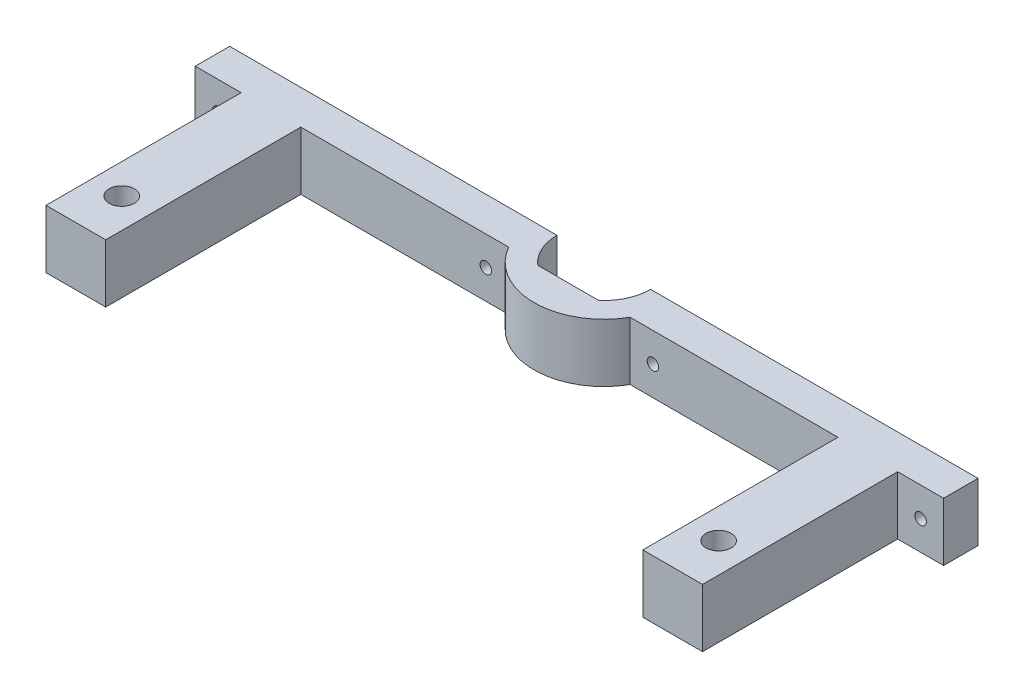
ISO-10303-21;
HEADER;
FILE_DESCRIPTION(('STEP AP214'),'2;1');
FILE_NAME('part.step','',(''),(''),'','','');
FILE_SCHEMA(('AUTOMOTIVE_DESIGN { 1 0 10303 214 1 1 1 1 }'));
ENDSEC;
DATA;
#1=APPLICATION_CONTEXT('core data for automotive mechanical design processes');
#2=APPLICATION_PROTOCOL_DEFINITION('international standard','automotive_design',2000,#1);
#3=PRODUCT_CONTEXT('',#1,'mechanical');
#4=PRODUCT('Part','Part','',(#3));
#5=PRODUCT_RELATED_PRODUCT_CATEGORY('part','',(#4));
#6=PRODUCT_DEFINITION_FORMATION('','',#4);
#7=PRODUCT_DEFINITION_CONTEXT('part definition',#1,'design');
#8=PRODUCT_DEFINITION('design','',#6,#7);
#9=PRODUCT_DEFINITION_SHAPE('','',#8);
#10=(LENGTH_UNIT() NAMED_UNIT(*) SI_UNIT(.MILLI.,.METRE.));
#11=(NAMED_UNIT(*) PLANE_ANGLE_UNIT() SI_UNIT($,.RADIAN.));
#12=(NAMED_UNIT(*) SI_UNIT($,.STERADIAN.) SOLID_ANGLE_UNIT());
#13=UNCERTAINTY_MEASURE_WITH_UNIT(LENGTH_MEASURE(1.E-05),#10,'distance_accuracy_value','');
#14=(GEOMETRIC_REPRESENTATION_CONTEXT(3) GLOBAL_UNCERTAINTY_ASSIGNED_CONTEXT((#13)) GLOBAL_UNIT_ASSIGNED_CONTEXT((#10,
#11,#12)) REPRESENTATION_CONTEXT('',''));
#15=CARTESIAN_POINT('',(0.,0.,0.));
#16=DIRECTION('',(0.,0.,1.));
#17=DIRECTION('',(1.,0.,0.));
#18=AXIS2_PLACEMENT_3D('',#15,#16,#17);
#19=CARTESIAN_POINT('',(3.50000000000001,-17.3,0.));
#20=DIRECTION('',(1.,0.,0.));
#21=DIRECTION('',(0.,0.,-1.));
#22=AXIS2_PLACEMENT_3D('',#19,#20,#21);
#23=PLANE('',#22);
#24=DIRECTION('',(0.,1.,0.));
#25=VECTOR('',#24,1.);
#26=CARTESIAN_POINT('',(3.50000000000001,0.,-42.5));
#27=LINE('',#26,#25);
#28=CARTESIAN_POINT('',(3.50000000000001,0.,-42.5));
#29=VERTEX_POINT('',#28);
#30=CARTESIAN_POINT('',(3.50000000000001,12.7,-42.5));
#31=VERTEX_POINT('',#30);
#32=EDGE_CURVE('E109',#29,#31,#27,.T.);
#33=ORIENTED_EDGE('',*,*,#32,.F.);
#34=DIRECTION('',(0.,0.,1.));
#35=VECTOR('',#34,1.);
#36=CARTESIAN_POINT('',(3.50000000000001,0.,0.));
#37=LINE('',#36,#35);
#38=CARTESIAN_POINT('',(3.50000000000001,0.,0.));
#39=VERTEX_POINT('',#38);
#40=EDGE_CURVE('E313',#29,#39,#37,.T.);
#41=ORIENTED_EDGE('',*,*,#40,.T.);
#42=DIRECTION('',(0.,-1.,0.));
#43=VECTOR('',#42,1.);
#44=CARTESIAN_POINT('',(3.50000000000001,12.7,0.));
#45=LINE('',#44,#43);
#46=CARTESIAN_POINT('',(3.50000000000001,12.7,0.));
#47=VERTEX_POINT('',#46);
#48=EDGE_CURVE('E363',#47,#39,#45,.T.);
#49=ORIENTED_EDGE('',*,*,#48,.F.);
#50=DIRECTION('',(0.,0.,-1.));
#51=VECTOR('',#50,1.);
#52=CARTESIAN_POINT('',(3.50000000000001,12.7,0.));
#53=LINE('',#52,#51);
#54=EDGE_CURVE('E278',#47,#31,#53,.T.);
#55=ORIENTED_EDGE('',*,*,#54,.T.);
#56=EDGE_LOOP('',(#33,#41,#49,#55));
#57=FACE_BOUND('',#56,.T.);
#58=ADVANCED_FACE('F92',(#57),#23,.F.);
#59=CARTESIAN_POINT('',(146.5,-17.3,0.));
#60=DIRECTION('',(-1.,0.,0.));
#61=DIRECTION('',(0.,0.,1.));
#62=AXIS2_PLACEMENT_3D('',#59,#60,#61);
#63=PLANE('',#62);
#64=DIRECTION('',(0.,-1.,0.));
#65=VECTOR('',#64,1.);
#66=CARTESIAN_POINT('',(146.5,0.,-42.5));
#67=LINE('',#66,#65);
#68=CARTESIAN_POINT('',(146.5,12.7,-42.5));
#69=VERTEX_POINT('',#68);
#70=CARTESIAN_POINT('',(146.5,0.,-42.5));
#71=VERTEX_POINT('',#70);
#72=EDGE_CURVE('E117',#69,#71,#67,.T.);
#73=ORIENTED_EDGE('',*,*,#72,.F.);
#74=DIRECTION('',(0.,0.,1.));
#75=VECTOR('',#74,1.);
#76=CARTESIAN_POINT('',(146.5,12.7,0.));
#77=LINE('',#76,#75);
#78=CARTESIAN_POINT('',(146.5,12.7,0.));
#79=VERTEX_POINT('',#78);
#80=EDGE_CURVE('E276',#69,#79,#77,.T.);
#81=ORIENTED_EDGE('',*,*,#80,.T.);
#82=DIRECTION('',(0.,1.,0.));
#83=VECTOR('',#82,1.);
#84=CARTESIAN_POINT('',(146.5,-17.3,0.));
#85=LINE('',#84,#83);
#86=CARTESIAN_POINT('',(146.5,0.,0.));
#87=VERTEX_POINT('',#86);
#88=EDGE_CURVE('E282',#87,#79,#85,.T.);
#89=ORIENTED_EDGE('',*,*,#88,.F.);
#90=DIRECTION('',(0.,0.,-1.));
#91=VECTOR('',#90,1.);
#92=CARTESIAN_POINT('',(146.5,0.,0.));
#93=LINE('',#92,#91);
#94=EDGE_CURVE('E311',#87,#71,#93,.T.);
#95=ORIENTED_EDGE('',*,*,#94,.T.);
#96=EDGE_LOOP('',(#73,#81,#89,#95));
#97=FACE_BOUND('',#96,.T.);
#98=ADVANCED_FACE('F400',(#97),#63,.F.);
#99=CARTESIAN_POINT('',(0.,12.7,0.));
#100=DIRECTION('',(0.,0.,-1.));
#101=DIRECTION('',(-1.,0.,0.));
#102=AXIS2_PLACEMENT_3D('',#99,#100,#101);
#103=PLANE('',#102);
#104=DIRECTION('',(1.,0.,0.));
#105=VECTOR('',#104,1.);
#106=CARTESIAN_POINT('',(0.,12.7,0.));
#107=LINE('',#106,#105);
#108=CARTESIAN_POINT('',(16.5,12.7,0.));
#109=VERTEX_POINT('',#108);
#110=EDGE_CURVE('E350',#47,#109,#107,.T.);
#111=ORIENTED_EDGE('',*,*,#110,.F.);
#112=ORIENTED_EDGE('',*,*,#48,.T.);
#113=DIRECTION('',(1.,0.,0.));
#114=VECTOR('',#113,1.);
#115=CARTESIAN_POINT('',(0.,0.,0.));
#116=LINE('',#115,#114);
#117=CARTESIAN_POINT('',(16.5,0.,0.));
#118=VERTEX_POINT('',#117);
#119=EDGE_CURVE('E351',#39,#118,#116,.T.);
#120=ORIENTED_EDGE('',*,*,#119,.T.);
#121=DIRECTION('',(0.,-1.,0.));
#122=VECTOR('',#121,1.);
#123=CARTESIAN_POINT('',(16.5,12.7,0.));
#124=LINE('',#123,#122);
#125=EDGE_CURVE('E358',#109,#118,#124,.T.);
#126=ORIENTED_EDGE('',*,*,#125,.F.);
#127=EDGE_LOOP('',(#111,#112,#120,#126));
#128=FACE_BOUND('',#127,.T.);
#129=ADVANCED_FACE('F405',(#128),#103,.F.);
#130=CARTESIAN_POINT('',(75.,0.,-50.));
#131=DIRECTION('',(0.,1.,0.));
#132=DIRECTION('',(0.,0.,1.));
#133=AXIS2_PLACEMENT_3D('',#130,#131,#132);
#134=CYLINDRICAL_SURFACE('',#133,10.2);
#135=CARTESIAN_POINT('',(75.,12.7,-50.));
#136=DIRECTION('',(0.,1.,0.));
#137=DIRECTION('',(0.,0.,1.));
#138=AXIS2_PLACEMENT_3D('',#135,#136,#137);
#139=CIRCLE('',#138,10.2);
#140=CARTESIAN_POINT('',(81.6315533625237,12.7,-42.25));
#141=VERTEX_POINT('',#140);
#142=CARTESIAN_POINT('',(85.2,12.7,-50.));
#143=VERTEX_POINT('',#142);
#144=EDGE_CURVE('E331',#141,#143,#139,.T.);
#145=ORIENTED_EDGE('',*,*,#144,.T.);
#146=DIRECTION('',(0.,1.,0.));
#147=VECTOR('',#146,1.);
#148=CARTESIAN_POINT('',(85.2,0.,-50.));
#149=LINE('',#148,#147);
#150=CARTESIAN_POINT('',(85.2,0.,-50.));
#151=VERTEX_POINT('',#150);
#152=EDGE_CURVE('E354',#151,#143,#149,.T.);
#153=ORIENTED_EDGE('',*,*,#152,.F.);
#154=CARTESIAN_POINT('',(75.,0.,-50.));
#155=DIRECTION('',(0.,1.,0.));
#156=DIRECTION('',(0.,0.,1.));
#157=AXIS2_PLACEMENT_3D('',#154,#155,#156);
#158=CIRCLE('',#157,10.2);
#159=CARTESIAN_POINT('',(81.6315533625237,0.,-42.25));
#160=VERTEX_POINT('',#159);
#161=EDGE_CURVE('E334',#160,#151,#158,.T.);
#162=ORIENTED_EDGE('',*,*,#161,.F.);
#163=DIRECTION('',(0.,1.,0.));
#164=VECTOR('',#163,1.);
#165=CARTESIAN_POINT('',(81.6315533625237,0.,-42.25));
#166=LINE('',#165,#164);
#167=EDGE_CURVE('E342',#160,#141,#166,.T.);
#168=ORIENTED_EDGE('',*,*,#167,.T.);
#169=EDGE_LOOP('',(#145,#153,#162,#168));
#170=FACE_BOUND('',#169,.T.);
#171=ADVANCED_FACE('F438',(#170),#134,.F.);
#172=CARTESIAN_POINT('',(0.,12.7,0.));
#173=DIRECTION('',(0.,-1.,0.));
#174=DIRECTION('',(0.,0.,-1.));
#175=AXIS2_PLACEMENT_3D('',#172,#173,#174);
#176=PLANE('',#175);
#177=CARTESIAN_POINT('',(75.,12.7,-50.));
#178=DIRECTION('',(0.,1.,0.));
#179=DIRECTION('',(0.,0.,1.));
#180=AXIS2_PLACEMENT_3D('',#177,#178,#179);
#181=CIRCLE('',#180,10.2);
#182=CARTESIAN_POINT('',(64.8,12.7,-50.));
#183=VERTEX_POINT('',#182);
#184=CARTESIAN_POINT('',(68.3684466374763,12.7,-42.25));
#185=VERTEX_POINT('',#184);
#186=EDGE_CURVE('E319',#183,#185,#181,.T.);
#187=ORIENTED_EDGE('',*,*,#186,.F.);
#188=DIRECTION('',(1.,0.,0.));
#189=VECTOR('',#188,1.);
#190=CARTESIAN_POINT('',(0.,12.7,-50.));
#191=LINE('',#190,#189);
#192=CARTESIAN_POINT('',(-6.49999999999999,12.7,-50.));
#193=VERTEX_POINT('',#192);
#194=EDGE_CURVE('E280',#193,#183,#191,.T.);
#195=ORIENTED_EDGE('',*,*,#194,.F.);
#196=DIRECTION('',(0.,0.,-1.));
#197=VECTOR('',#196,1.);
#198=CARTESIAN_POINT('',(-6.49999999999999,12.7,-50.));
#199=LINE('',#198,#197);
#200=CARTESIAN_POINT('',(-6.49999999999999,12.7,-42.5));
#201=VERTEX_POINT('',#200);
#202=EDGE_CURVE('E243',#201,#193,#199,.T.);
#203=ORIENTED_EDGE('',*,*,#202,.F.);
#204=DIRECTION('',(1.,0.,0.));
#205=VECTOR('',#204,1.);
#206=CARTESIAN_POINT('',(-6.49999999999999,12.7,-42.5));
#207=LINE('',#206,#205);
#208=EDGE_CURVE('E251',#201,#31,#207,.T.);
#209=ORIENTED_EDGE('',*,*,#208,.T.);
#210=ORIENTED_EDGE('',*,*,#54,.F.);
#211=ORIENTED_EDGE('',*,*,#110,.T.);
#212=DIRECTION('',(0.,0.,-1.));
#213=VECTOR('',#212,1.);
#214=CARTESIAN_POINT('',(16.5,12.7,0.));
#215=LINE('',#214,#213);
#216=CARTESIAN_POINT('',(16.5,12.7,-42.5));
#217=VERTEX_POINT('',#216);
#218=EDGE_CURVE('E291',#109,#217,#215,.T.);
#219=ORIENTED_EDGE('',*,*,#218,.T.);
#220=DIRECTION('',(-1.,0.,0.));
#221=VECTOR('',#220,1.);
#222=CARTESIAN_POINT('',(0.,12.7,-42.5));
#223=LINE('',#222,#221);
#224=CARTESIAN_POINT('',(61.7791830812162,12.7,-42.5));
#225=VERTEX_POINT('',#224);
#226=EDGE_CURVE('E288',#225,#217,#223,.T.);
#227=ORIENTED_EDGE('',*,*,#226,.F.);
#228=CARTESIAN_POINT('',(75.,12.7,-50.));
#229=DIRECTION('',(0.,1.,0.));
#230=DIRECTION('',(0.,0.,1.));
#231=AXIS2_PLACEMENT_3D('',#228,#229,#230);
#232=CIRCLE('',#231,15.2);
#233=CARTESIAN_POINT('',(88.2208169187838,12.7,-42.5));
#234=VERTEX_POINT('',#233);
#235=EDGE_CURVE('E285',#225,#234,#232,.T.);
#236=ORIENTED_EDGE('',*,*,#235,.T.);
#237=CARTESIAN_POINT('',(133.5,12.7,-42.5));
#238=VERTEX_POINT('',#237);
#239=EDGE_CURVE('E292',#238,#234,#223,.T.);
#240=ORIENTED_EDGE('',*,*,#239,.F.);
#241=DIRECTION('',(0.,0.,-1.));
#242=VECTOR('',#241,1.);
#243=CARTESIAN_POINT('',(133.5,12.7,0.));
#244=LINE('',#243,#242);
#245=CARTESIAN_POINT('',(133.5,12.7,0.));
#246=VERTEX_POINT('',#245);
#247=EDGE_CURVE('E295',#246,#238,#244,.T.);
#248=ORIENTED_EDGE('',*,*,#247,.F.);
#249=EDGE_CURVE('E347',#246,#79,#107,.T.);
#250=ORIENTED_EDGE('',*,*,#249,.T.);
#251=ORIENTED_EDGE('',*,*,#80,.F.);
#252=DIRECTION('',(-1.,0.,0.));
#253=VECTOR('',#252,1.);
#254=CARTESIAN_POINT('',(156.5,12.7,-42.5));
#255=LINE('',#254,#253);
#256=CARTESIAN_POINT('',(156.5,12.7,-42.5));
#257=VERTEX_POINT('',#256);
#258=EDGE_CURVE('E270',#257,#69,#255,.T.);
#259=ORIENTED_EDGE('',*,*,#258,.F.);
#260=DIRECTION('',(0.,0.,1.));
#261=VECTOR('',#260,1.);
#262=CARTESIAN_POINT('',(156.5,12.7,-50.));
#263=LINE('',#262,#261);
#264=CARTESIAN_POINT('',(156.5,12.7,-50.));
#265=VERTEX_POINT('',#264);
#266=EDGE_CURVE('E259',#265,#257,#263,.T.);
#267=ORIENTED_EDGE('',*,*,#266,.F.);
#268=DIRECTION('',(-1.,0.,0.));
#269=VECTOR('',#268,1.);
#270=CARTESIAN_POINT('',(0.,12.7,-50.));
#271=LINE('',#270,#269);
#272=EDGE_CURVE('E273',#265,#143,#271,.T.);
#273=ORIENTED_EDGE('',*,*,#272,.T.);
#274=ORIENTED_EDGE('',*,*,#144,.F.);
#275=DIRECTION('',(1.,0.,0.));
#276=VECTOR('',#275,1.);
#277=CARTESIAN_POINT('',(0.,12.7,-42.25));
#278=LINE('',#277,#276);
#279=EDGE_CURVE('E338',#185,#141,#278,.T.);
#280=ORIENTED_EDGE('',*,*,#279,.F.);
#281=EDGE_LOOP('',(#187,#195,#203,#209,#210,#211,#219,#227,#236,#240,#248,#250,#251,#259,#267,
#273,#274,#280));
#282=FACE_BOUND('',#281,.T.);
#283=CARTESIAN_POINT('',(140.,12.7,-10.));
#284=DIRECTION('',(0.,1.,0.));
#285=DIRECTION('',(0.,0.,1.));
#286=AXIS2_PLACEMENT_3D('',#283,#284,#285);
#287=CIRCLE('',#286,2.75000000000001);
#288=CARTESIAN_POINT('',(140.,12.7,-7.25000000000003));
#289=VERTEX_POINT('',#288);
#290=EDGE_CURVE('E316',#289,#289,#287,.T.);
#291=ORIENTED_EDGE('',*,*,#290,.F.);
#292=EDGE_LOOP('',(#291));
#293=FACE_BOUND('',#292,.T.);
#294=CARTESIAN_POINT('',(10.,12.7,-10.));
#295=DIRECTION('',(0.,-1.,0.));
#296=DIRECTION('',(0.,0.,-1.));
#297=AXIS2_PLACEMENT_3D('',#294,#295,#296);
#298=CIRCLE('',#297,2.75);
#299=CARTESIAN_POINT('',(10.,12.7,-12.75));
#300=VERTEX_POINT('',#299);
#301=EDGE_CURVE('E323',#300,#300,#298,.T.);
#302=ORIENTED_EDGE('',*,*,#301,.T.);
#303=EDGE_LOOP('',(#302));
#304=FACE_BOUND('',#303,.T.);
#305=ADVANCED_FACE('F441',(#282,#293,#304),#176,.F.);
#306=CARTESIAN_POINT('',(0.,0.,0.));
#307=DIRECTION('',(0.,-1.,0.));
#308=DIRECTION('',(0.,0.,-1.));
#309=AXIS2_PLACEMENT_3D('',#306,#307,#308);
#310=PLANE('',#309);
#311=DIRECTION('',(-1.,0.,0.));
#312=VECTOR('',#311,1.);
#313=CARTESIAN_POINT('',(0.,0.,-50.));
#314=LINE('',#313,#312);
#315=CARTESIAN_POINT('',(64.8,0.,-50.));
#316=VERTEX_POINT('',#315);
#317=CARTESIAN_POINT('',(-6.49999999999999,0.,-50.));
#318=VERTEX_POINT('',#317);
#319=EDGE_CURVE('E218',#316,#318,#314,.T.);
#320=ORIENTED_EDGE('',*,*,#319,.F.);
#321=CARTESIAN_POINT('',(75.,0.,-50.));
#322=DIRECTION('',(0.,1.,0.));
#323=DIRECTION('',(0.,0.,1.));
#324=AXIS2_PLACEMENT_3D('',#321,#322,#323);
#325=CIRCLE('',#324,10.2);
#326=CARTESIAN_POINT('',(68.3684466374763,0.,-42.25));
#327=VERTEX_POINT('',#326);
#328=EDGE_CURVE('E328',#316,#327,#325,.T.);
#329=ORIENTED_EDGE('',*,*,#328,.T.);
#330=DIRECTION('',(1.,0.,0.));
#331=VECTOR('',#330,1.);
#332=CARTESIAN_POINT('',(0.,0.,-42.25));
#333=LINE('',#332,#331);
#334=EDGE_CURVE('E330',#327,#160,#333,.T.);
#335=ORIENTED_EDGE('',*,*,#334,.T.);
#336=ORIENTED_EDGE('',*,*,#161,.T.);
#337=DIRECTION('',(1.,0.,0.));
#338=VECTOR('',#337,1.);
#339=CARTESIAN_POINT('',(0.,0.,-50.));
#340=LINE('',#339,#338);
#341=CARTESIAN_POINT('',(156.5,0.,-50.));
#342=VERTEX_POINT('',#341);
#343=EDGE_CURVE('E228',#151,#342,#340,.T.);
#344=ORIENTED_EDGE('',*,*,#343,.T.);
#345=DIRECTION('',(0.,0.,-1.));
#346=VECTOR('',#345,1.);
#347=CARTESIAN_POINT('',(156.5,0.,-50.));
#348=LINE('',#347,#346);
#349=CARTESIAN_POINT('',(156.5,0.,-42.5));
#350=VERTEX_POINT('',#349);
#351=EDGE_CURVE('E263',#350,#342,#348,.T.);
#352=ORIENTED_EDGE('',*,*,#351,.F.);
#353=DIRECTION('',(-1.,0.,0.));
#354=VECTOR('',#353,1.);
#355=CARTESIAN_POINT('',(156.5,0.,-42.5));
#356=LINE('',#355,#354);
#357=EDGE_CURVE('E266',#350,#71,#356,.T.);
#358=ORIENTED_EDGE('',*,*,#357,.T.);
#359=ORIENTED_EDGE('',*,*,#94,.F.);
#360=CARTESIAN_POINT('',(133.5,0.,0.));
#361=VERTEX_POINT('',#360);
#362=EDGE_CURVE('E344',#361,#87,#116,.T.);
#363=ORIENTED_EDGE('',*,*,#362,.F.);
#364=DIRECTION('',(0.,0.,1.));
#365=VECTOR('',#364,1.);
#366=CARTESIAN_POINT('',(133.5,0.,0.));
#367=LINE('',#366,#365);
#368=CARTESIAN_POINT('',(133.5,0.,-42.5));
#369=VERTEX_POINT('',#368);
#370=EDGE_CURVE('E309',#369,#361,#367,.T.);
#371=ORIENTED_EDGE('',*,*,#370,.F.);
#372=DIRECTION('',(1.,0.,0.));
#373=VECTOR('',#372,1.);
#374=CARTESIAN_POINT('',(0.,0.,-42.5));
#375=LINE('',#374,#373);
#376=CARTESIAN_POINT('',(88.2208169187838,0.,-42.5));
#377=VERTEX_POINT('',#376);
#378=EDGE_CURVE('E12',#377,#369,#375,.T.);
#379=ORIENTED_EDGE('',*,*,#378,.F.);
#380=CARTESIAN_POINT('',(75.,0.,-50.));
#381=DIRECTION('',(0.,-1.,0.));
#382=DIRECTION('',(0.,0.,-1.));
#383=AXIS2_PLACEMENT_3D('',#380,#381,#382);
#384=CIRCLE('',#383,15.2);
#385=CARTESIAN_POINT('',(61.7791830812162,0.,-42.5));
#386=VERTEX_POINT('',#385);
#387=EDGE_CURVE('E101',#377,#386,#384,.T.);
#388=ORIENTED_EDGE('',*,*,#387,.T.);
#389=DIRECTION('',(1.,0.,0.));
#390=VECTOR('',#389,1.);
#391=CARTESIAN_POINT('',(0.,0.,-42.5));
#392=LINE('',#391,#390);
#393=CARTESIAN_POINT('',(16.5,0.,-42.5));
#394=VERTEX_POINT('',#393);
#395=EDGE_CURVE('E366',#394,#386,#392,.T.);
#396=ORIENTED_EDGE('',*,*,#395,.F.);
#397=DIRECTION('',(0.,0.,1.));
#398=VECTOR('',#397,1.);
#399=CARTESIAN_POINT('',(16.5,0.,0.));
#400=LINE('',#399,#398);
#401=EDGE_CURVE('E227',#394,#118,#400,.T.);
#402=ORIENTED_EDGE('',*,*,#401,.T.);
#403=ORIENTED_EDGE('',*,*,#119,.F.);
#404=ORIENTED_EDGE('',*,*,#40,.F.);
#405=DIRECTION('',(1.,0.,0.));
#406=VECTOR('',#405,1.);
#407=CARTESIAN_POINT('',(-6.49999999999999,0.,-42.5));
#408=LINE('',#407,#406);
#409=CARTESIAN_POINT('',(-6.49999999999999,0.,-42.5));
#410=VERTEX_POINT('',#409);
#411=EDGE_CURVE('E235',#410,#29,#408,.T.);
#412=ORIENTED_EDGE('',*,*,#411,.F.);
#413=DIRECTION('',(0.,0.,1.));
#414=VECTOR('',#413,1.);
#415=CARTESIAN_POINT('',(-6.49999999999999,0.,-50.));
#416=LINE('',#415,#414);
#417=EDGE_CURVE('E231',#318,#410,#416,.T.);
#418=ORIENTED_EDGE('',*,*,#417,.F.);
#419=EDGE_LOOP('',(#320,#329,#335,#336,#344,#352,#358,#359,#363,#371,#379,#388,#396,#402,#403,
#404,#412,#418));
#420=FACE_BOUND('',#419,.T.);
#421=CARTESIAN_POINT('',(140.,0.,-10.));
#422=DIRECTION('',(0.,1.,0.));
#423=DIRECTION('',(0.,0.,1.));
#424=AXIS2_PLACEMENT_3D('',#421,#422,#423);
#425=CIRCLE('',#424,2.75000000000001);
#426=CARTESIAN_POINT('',(140.,0.,-7.25000000000003));
#427=VERTEX_POINT('',#426);
#428=EDGE_CURVE('E320',#427,#427,#425,.T.);
#429=ORIENTED_EDGE('',*,*,#428,.T.);
#430=EDGE_LOOP('',(#429));
#431=FACE_BOUND('',#430,.T.);
#432=CARTESIAN_POINT('',(10.,0.,-10.));
#433=DIRECTION('',(0.,-1.,0.));
#434=DIRECTION('',(0.,0.,-1.));
#435=AXIS2_PLACEMENT_3D('',#432,#433,#434);
#436=CIRCLE('',#435,2.75);
#437=CARTESIAN_POINT('',(10.,0.,-12.75));
#438=VERTEX_POINT('',#437);
#439=EDGE_CURVE('E315',#438,#438,#436,.T.);
#440=ORIENTED_EDGE('',*,*,#439,.F.);
#441=EDGE_LOOP('',(#440));
#442=FACE_BOUND('',#441,.T.);
#443=ADVANCED_FACE('F232',(#420,#431,#442),#310,.T.);
#444=ORIENTED_EDGE('',*,*,#362,.T.);
#445=ORIENTED_EDGE('',*,*,#88,.T.);
#446=ORIENTED_EDGE('',*,*,#249,.F.);
#447=DIRECTION('',(0.,-1.,0.));
#448=VECTOR('',#447,1.);
#449=CARTESIAN_POINT('',(133.5,12.7,0.));
#450=LINE('',#449,#448);
#451=EDGE_CURVE('E360',#246,#361,#450,.T.);
#452=ORIENTED_EDGE('',*,*,#451,.T.);
#453=EDGE_LOOP('',(#444,#445,#446,#452));
#454=FACE_BOUND('',#453,.T.);
#455=ADVANCED_FACE('F94',(#454),#103,.F.);
#456=CARTESIAN_POINT('',(75.,0.,-50.));
#457=DIRECTION('',(0.,1.,0.));
#458=DIRECTION('',(0.,0.,1.));
#459=AXIS2_PLACEMENT_3D('',#456,#457,#458);
#460=CYLINDRICAL_SURFACE('',#459,10.2);
#461=ORIENTED_EDGE('',*,*,#328,.F.);
#462=DIRECTION('',(0.,1.,0.));
#463=VECTOR('',#462,1.);
#464=CARTESIAN_POINT('',(64.8,0.,-50.));
#465=LINE('',#464,#463);
#466=EDGE_CURVE('E224',#316,#183,#465,.T.);
#467=ORIENTED_EDGE('',*,*,#466,.T.);
#468=ORIENTED_EDGE('',*,*,#186,.T.);
#469=DIRECTION('',(0.,1.,0.));
#470=VECTOR('',#469,1.);
#471=CARTESIAN_POINT('',(68.3684466374763,0.,-42.25));
#472=LINE('',#471,#470);
#473=EDGE_CURVE('E336',#327,#185,#472,.T.);
#474=ORIENTED_EDGE('',*,*,#473,.F.);
#475=EDGE_LOOP('',(#461,#467,#468,#474));
#476=FACE_BOUND('',#475,.T.);
#477=ADVANCED_FACE('F445',(#476),#460,.F.);
#478=CARTESIAN_POINT('',(0.,0.,-42.25));
#479=DIRECTION('',(0.,0.,1.));
#480=DIRECTION('',(1.,0.,0.));
#481=AXIS2_PLACEMENT_3D('',#478,#479,#480);
#482=PLANE('',#481);
#483=ORIENTED_EDGE('',*,*,#279,.T.);
#484=ORIENTED_EDGE('',*,*,#167,.F.);
#485=ORIENTED_EDGE('',*,*,#334,.F.);
#486=ORIENTED_EDGE('',*,*,#473,.T.);
#487=EDGE_LOOP('',(#483,#484,#485,#486));
#488=FACE_BOUND('',#487,.T.);
#489=ADVANCED_FACE('F433',(#488),#482,.F.);
#490=CARTESIAN_POINT('',(140.,0.,-10.));
#491=DIRECTION('',(0.,1.,0.));
#492=DIRECTION('',(0.,0.,1.));
#493=AXIS2_PLACEMENT_3D('',#490,#491,#492);
#494=CYLINDRICAL_SURFACE('',#493,2.75000000000001);
#495=ORIENTED_EDGE('',*,*,#428,.F.);
#496=EDGE_LOOP('',(#495));
#497=FACE_BOUND('',#496,.T.);
#498=ORIENTED_EDGE('',*,*,#290,.T.);
#499=EDGE_LOOP('',(#498));
#500=FACE_BOUND('',#499,.T.);
#501=ADVANCED_FACE('F430',(#497,#500),#494,.F.);
#502=CARTESIAN_POINT('',(10.,0.,-10.));
#503=DIRECTION('',(0.,1.,0.));
#504=DIRECTION('',(0.,0.,1.));
#505=AXIS2_PLACEMENT_3D('',#502,#503,#504);
#506=CYLINDRICAL_SURFACE('',#505,2.75);
#507=ORIENTED_EDGE('',*,*,#439,.T.);
#508=EDGE_LOOP('',(#507));
#509=FACE_BOUND('',#508,.T.);
#510=ORIENTED_EDGE('',*,*,#301,.F.);
#511=EDGE_LOOP('',(#510));
#512=FACE_BOUND('',#511,.T.);
#513=ADVANCED_FACE('F413',(#509,#512),#506,.F.);
#514=CARTESIAN_POINT('',(0.,-17.3,-50.));
#515=DIRECTION('',(0.,0.,-1.));
#516=DIRECTION('',(-1.,0.,0.));
#517=AXIS2_PLACEMENT_3D('',#514,#515,#516);
#518=PLANE('',#517);
#519=CARTESIAN_POINT('',(151.5,6.35,-50.));
#520=DIRECTION('',(0.,0.,-1.));
#521=DIRECTION('',(-1.,0.,0.));
#522=AXIS2_PLACEMENT_3D('',#519,#520,#521);
#523=CIRCLE('',#522,1.25000000000001);
#524=CARTESIAN_POINT('',(150.25,6.35,-50.));
#525=VERTEX_POINT('',#524);
#526=EDGE_CURVE('E374',#525,#525,#523,.T.);
#527=ORIENTED_EDGE('',*,*,#526,.F.);
#528=EDGE_LOOP('',(#527));
#529=FACE_BOUND('',#528,.T.);
#530=CARTESIAN_POINT('',(93.2,6.35,-50.));
#531=DIRECTION('',(0.,0.,-1.));
#532=DIRECTION('',(-1.,0.,0.));
#533=AXIS2_PLACEMENT_3D('',#530,#531,#532);
#534=CIRCLE('',#533,1.25);
#535=CARTESIAN_POINT('',(91.95,6.35,-50.));
#536=VERTEX_POINT('',#535);
#537=EDGE_CURVE('E523',#536,#536,#534,.T.);
#538=ORIENTED_EDGE('',*,*,#537,.F.);
#539=EDGE_LOOP('',(#538));
#540=FACE_BOUND('',#539,.T.);
#541=ORIENTED_EDGE('',*,*,#152,.T.);
#542=ORIENTED_EDGE('',*,*,#272,.F.);
#543=DIRECTION('',(0.,1.,0.));
#544=VECTOR('',#543,1.);
#545=CARTESIAN_POINT('',(156.5,0.,-50.));
#546=LINE('',#545,#544);
#547=EDGE_CURVE('E256',#342,#265,#546,.T.);
#548=ORIENTED_EDGE('',*,*,#547,.F.);
#549=ORIENTED_EDGE('',*,*,#343,.F.);
#550=EDGE_LOOP('',(#541,#542,#548,#549));
#551=FACE_BOUND('',#550,.T.);
#552=ADVANCED_FACE('F410',(#529,#540,#551),#518,.T.);
#553=CARTESIAN_POINT('',(0.,-17.3,-50.));
#554=DIRECTION('',(0.,0.,1.));
#555=DIRECTION('',(1.,0.,0.));
#556=AXIS2_PLACEMENT_3D('',#553,#554,#555);
#557=PLANE('',#556);
#558=CARTESIAN_POINT('',(56.8,6.35,-50.));
#559=DIRECTION('',(0.,0.,1.));
#560=DIRECTION('',(1.,0.,0.));
#561=AXIS2_PLACEMENT_3D('',#558,#559,#560);
#562=CIRCLE('',#561,1.25);
#563=CARTESIAN_POINT('',(58.05,6.35,-50.));
#564=VERTEX_POINT('',#563);
#565=EDGE_CURVE('E521',#564,#564,#562,.T.);
#566=ORIENTED_EDGE('',*,*,#565,.T.);
#567=EDGE_LOOP('',(#566));
#568=FACE_BOUND('',#567,.T.);
#569=CARTESIAN_POINT('',(-1.49999999999997,6.35,-50.));
#570=DIRECTION('',(0.,0.,1.));
#571=DIRECTION('',(1.,0.,0.));
#572=AXIS2_PLACEMENT_3D('',#569,#570,#571);
#573=CIRCLE('',#572,1.25);
#574=CARTESIAN_POINT('',(-0.249999999999973,6.35,-50.));
#575=VERTEX_POINT('',#574);
#576=EDGE_CURVE('E247',#575,#575,#573,.T.);
#577=ORIENTED_EDGE('',*,*,#576,.T.);
#578=EDGE_LOOP('',(#577));
#579=FACE_BOUND('',#578,.T.);
#580=ORIENTED_EDGE('',*,*,#319,.T.);
#581=DIRECTION('',(0.,-1.,0.));
#582=VECTOR('',#581,1.);
#583=CARTESIAN_POINT('',(-6.49999999999999,0.,-50.));
#584=LINE('',#583,#582);
#585=EDGE_CURVE('E222',#193,#318,#584,.T.);
#586=ORIENTED_EDGE('',*,*,#585,.F.);
#587=ORIENTED_EDGE('',*,*,#194,.T.);
#588=ORIENTED_EDGE('',*,*,#466,.F.);
#589=EDGE_LOOP('',(#580,#586,#587,#588));
#590=FACE_BOUND('',#589,.T.);
#591=ADVANCED_FACE('F220',(#568,#579,#590),#557,.F.);
#592=CARTESIAN_POINT('',(75.,-17.3,-50.));
#593=DIRECTION('',(0.,1.,0.));
#594=DIRECTION('',(0.,0.,1.));
#595=AXIS2_PLACEMENT_3D('',#592,#593,#594);
#596=CYLINDRICAL_SURFACE('',#595,15.2);
#597=DIRECTION('',(0.,1.,0.));
#598=VECTOR('',#597,1.);
#599=CARTESIAN_POINT('',(88.2208169187838,-17.3,-42.5));
#600=LINE('',#599,#598);
#601=EDGE_CURVE('E298',#377,#234,#600,.T.);
#602=ORIENTED_EDGE('',*,*,#601,.T.);
#603=ORIENTED_EDGE('',*,*,#235,.F.);
#604=DIRECTION('',(0.,1.,0.));
#605=VECTOR('',#604,1.);
#606=CARTESIAN_POINT('',(61.7791830812162,-17.3,-42.5));
#607=LINE('',#606,#605);
#608=EDGE_CURVE('E304',#386,#225,#607,.T.);
#609=ORIENTED_EDGE('',*,*,#608,.F.);
#610=ORIENTED_EDGE('',*,*,#387,.F.);
#611=EDGE_LOOP('',(#602,#603,#609,#610));
#612=FACE_BOUND('',#611,.T.);
#613=ADVANCED_FACE('F418',(#612),#596,.T.);
#614=CARTESIAN_POINT('',(0.,-17.3,-42.5));
#615=DIRECTION('',(0.,0.,-1.));
#616=DIRECTION('',(-1.,0.,0.));
#617=AXIS2_PLACEMENT_3D('',#614,#615,#616);
#618=PLANE('',#617);
#619=CARTESIAN_POINT('',(93.2,6.35,-42.5));
#620=DIRECTION('',(0.,0.,-1.));
#621=DIRECTION('',(-1.,0.,0.));
#622=AXIS2_PLACEMENT_3D('',#619,#620,#621);
#623=CIRCLE('',#622,1.25);
#624=CARTESIAN_POINT('',(91.95,6.35,-42.5));
#625=VERTEX_POINT('',#624);
#626=EDGE_CURVE('E96',#625,#625,#623,.T.);
#627=ORIENTED_EDGE('',*,*,#626,.T.);
#628=EDGE_LOOP('',(#627));
#629=FACE_BOUND('',#628,.T.);
#630=ORIENTED_EDGE('',*,*,#378,.T.);
#631=DIRECTION('',(0.,1.,0.));
#632=VECTOR('',#631,1.);
#633=CARTESIAN_POINT('',(133.5,-17.3,-42.5));
#634=LINE('',#633,#632);
#635=EDGE_CURVE('E300',#369,#238,#634,.T.);
#636=ORIENTED_EDGE('',*,*,#635,.T.);
#637=ORIENTED_EDGE('',*,*,#239,.T.);
#638=ORIENTED_EDGE('',*,*,#601,.F.);
#639=EDGE_LOOP('',(#630,#636,#637,#638));
#640=FACE_BOUND('',#639,.T.);
#641=ADVANCED_FACE('F383',(#629,#640),#618,.F.);
#642=CARTESIAN_POINT('',(133.5,-17.3,0.));
#643=DIRECTION('',(1.,0.,0.));
#644=DIRECTION('',(0.,0.,-1.));
#645=AXIS2_PLACEMENT_3D('',#642,#643,#644);
#646=PLANE('',#645);
#647=ORIENTED_EDGE('',*,*,#370,.T.);
#648=ORIENTED_EDGE('',*,*,#451,.F.);
#649=ORIENTED_EDGE('',*,*,#247,.T.);
#650=ORIENTED_EDGE('',*,*,#635,.F.);
#651=EDGE_LOOP('',(#647,#648,#649,#650));
#652=FACE_BOUND('',#651,.T.);
#653=ADVANCED_FACE('F417',(#652),#646,.F.);
#654=CARTESIAN_POINT('',(16.5,-17.3,0.));
#655=DIRECTION('',(1.,0.,0.));
#656=DIRECTION('',(0.,0.,-1.));
#657=AXIS2_PLACEMENT_3D('',#654,#655,#656);
#658=PLANE('',#657);
#659=DIRECTION('',(0.,1.,0.));
#660=VECTOR('',#659,1.);
#661=CARTESIAN_POINT('',(16.5,-17.3,-42.5));
#662=LINE('',#661,#660);
#663=EDGE_CURVE('E302',#394,#217,#662,.T.);
#664=ORIENTED_EDGE('',*,*,#663,.T.);
#665=ORIENTED_EDGE('',*,*,#218,.F.);
#666=ORIENTED_EDGE('',*,*,#125,.T.);
#667=ORIENTED_EDGE('',*,*,#401,.F.);
#668=EDGE_LOOP('',(#664,#665,#666,#667));
#669=FACE_BOUND('',#668,.T.);
#670=ADVANCED_FACE('F422',(#669),#658,.T.);
#671=CARTESIAN_POINT('',(56.8,6.35,-42.5));
#672=DIRECTION('',(0.,0.,-1.));
#673=DIRECTION('',(-1.,0.,0.));
#674=AXIS2_PLACEMENT_3D('',#671,#672,#673);
#675=CIRCLE('',#674,1.25);
#676=CARTESIAN_POINT('',(55.55,6.35,-42.5));
#677=VERTEX_POINT('',#676);
#678=EDGE_CURVE('E376',#677,#677,#675,.F.);
#679=ORIENTED_EDGE('',*,*,#678,.F.);
#680=EDGE_LOOP('',(#679));
#681=FACE_BOUND('',#680,.T.);
#682=ORIENTED_EDGE('',*,*,#395,.T.);
#683=ORIENTED_EDGE('',*,*,#608,.T.);
#684=ORIENTED_EDGE('',*,*,#226,.T.);
#685=ORIENTED_EDGE('',*,*,#663,.F.);
#686=EDGE_LOOP('',(#682,#683,#684,#685));
#687=FACE_BOUND('',#686,.T.);
#688=ADVANCED_FACE('F419',(#681,#687),#618,.F.);
#689=CARTESIAN_POINT('',(156.5,0.,-42.5));
#690=DIRECTION('',(0.,0.,-1.));
#691=DIRECTION('',(-1.,0.,0.));
#692=AXIS2_PLACEMENT_3D('',#689,#690,#691);
#693=PLANE('',#692);
#694=CARTESIAN_POINT('',(151.5,6.35,-42.5));
#695=DIRECTION('',(0.,0.,-1.));
#696=DIRECTION('',(-1.,0.,0.));
#697=AXIS2_PLACEMENT_3D('',#694,#695,#696);
#698=CIRCLE('',#697,1.25000000000001);
#699=CARTESIAN_POINT('',(150.25,6.35,-42.5));
#700=VERTEX_POINT('',#699);
#701=EDGE_CURVE('E373',#700,#700,#698,.T.);
#702=ORIENTED_EDGE('',*,*,#701,.T.);
#703=EDGE_LOOP('',(#702));
#704=FACE_BOUND('',#703,.T.);
#705=ORIENTED_EDGE('',*,*,#72,.T.);
#706=ORIENTED_EDGE('',*,*,#357,.F.);
#707=DIRECTION('',(0.,-1.,0.));
#708=VECTOR('',#707,1.);
#709=CARTESIAN_POINT('',(156.5,0.,-42.5));
#710=LINE('',#709,#708);
#711=EDGE_CURVE('E261',#257,#350,#710,.T.);
#712=ORIENTED_EDGE('',*,*,#711,.F.);
#713=ORIENTED_EDGE('',*,*,#258,.T.);
#714=EDGE_LOOP('',(#705,#706,#712,#713));
#715=FACE_BOUND('',#714,.T.);
#716=ADVANCED_FACE('F494',(#704,#715),#693,.F.);
#717=CARTESIAN_POINT('',(156.5,0.,0.));
#718=DIRECTION('',(1.,0.,0.));
#719=DIRECTION('',(0.,0.,-1.));
#720=AXIS2_PLACEMENT_3D('',#717,#718,#719);
#721=PLANE('',#720);
#722=ORIENTED_EDGE('',*,*,#547,.T.);
#723=ORIENTED_EDGE('',*,*,#266,.T.);
#724=ORIENTED_EDGE('',*,*,#711,.T.);
#725=ORIENTED_EDGE('',*,*,#351,.T.);
#726=EDGE_LOOP('',(#722,#723,#724,#725));
#727=FACE_BOUND('',#726,.T.);
#728=ADVANCED_FACE('F488',(#727),#721,.T.);
#729=CARTESIAN_POINT('',(-6.49999999999999,0.,-42.5));
#730=DIRECTION('',(0.,0.,-1.));
#731=DIRECTION('',(-1.,0.,0.));
#732=AXIS2_PLACEMENT_3D('',#729,#730,#731);
#733=PLANE('',#732);
#734=CARTESIAN_POINT('',(-1.49999999999997,6.35,-42.5));
#735=DIRECTION('',(0.,0.,-1.));
#736=DIRECTION('',(-1.,0.,0.));
#737=AXIS2_PLACEMENT_3D('',#734,#735,#736);
#738=CIRCLE('',#737,1.25);
#739=CARTESIAN_POINT('',(-2.74999999999997,6.35,-42.5));
#740=VERTEX_POINT('',#739);
#741=EDGE_CURVE('E370',#740,#740,#738,.F.);
#742=ORIENTED_EDGE('',*,*,#741,.F.);
#743=EDGE_LOOP('',(#742));
#744=FACE_BOUND('',#743,.T.);
#745=ORIENTED_EDGE('',*,*,#32,.T.);
#746=ORIENTED_EDGE('',*,*,#208,.F.);
#747=DIRECTION('',(0.,1.,0.));
#748=VECTOR('',#747,1.);
#749=CARTESIAN_POINT('',(-6.49999999999999,0.,-42.5));
#750=LINE('',#749,#748);
#751=EDGE_CURVE('E238',#410,#201,#750,.T.);
#752=ORIENTED_EDGE('',*,*,#751,.F.);
#753=ORIENTED_EDGE('',*,*,#411,.T.);
#754=EDGE_LOOP('',(#745,#746,#752,#753));
#755=FACE_BOUND('',#754,.T.);
#756=ADVANCED_FACE('F474',(#744,#755),#733,.F.);
#757=CARTESIAN_POINT('',(-6.49999999999999,0.,0.));
#758=DIRECTION('',(1.,0.,0.));
#759=DIRECTION('',(0.,0.,-1.));
#760=AXIS2_PLACEMENT_3D('',#757,#758,#759);
#761=PLANE('',#760);
#762=ORIENTED_EDGE('',*,*,#585,.T.);
#763=ORIENTED_EDGE('',*,*,#417,.T.);
#764=ORIENTED_EDGE('',*,*,#751,.T.);
#765=ORIENTED_EDGE('',*,*,#202,.T.);
#766=EDGE_LOOP('',(#762,#763,#764,#765));
#767=FACE_BOUND('',#766,.T.);
#768=ADVANCED_FACE('F241',(#767),#761,.F.);
#769=CARTESIAN_POINT('',(-1.49999999999997,6.35,-10.));
#770=DIRECTION('',(0.,0.,-1.));
#771=DIRECTION('',(-1.,0.,0.));
#772=AXIS2_PLACEMENT_3D('',#769,#770,#771);
#773=CYLINDRICAL_SURFACE('',#772,1.25);
#774=ORIENTED_EDGE('',*,*,#576,.F.);
#775=EDGE_LOOP('',(#774));
#776=FACE_BOUND('',#775,.T.);
#777=ORIENTED_EDGE('',*,*,#741,.T.);
#778=EDGE_LOOP('',(#777));
#779=FACE_BOUND('',#778,.T.);
#780=ADVANCED_FACE('F509',(#776,#779),#773,.F.);
#781=CARTESIAN_POINT('',(151.5,6.35,-10.));
#782=DIRECTION('',(0.,0.,-1.));
#783=DIRECTION('',(-1.,0.,0.));
#784=AXIS2_PLACEMENT_3D('',#781,#782,#783);
#785=CYLINDRICAL_SURFACE('',#784,1.25000000000001);
#786=ORIENTED_EDGE('',*,*,#526,.T.);
#787=EDGE_LOOP('',(#786));
#788=FACE_BOUND('',#787,.T.);
#789=ORIENTED_EDGE('',*,*,#701,.F.);
#790=EDGE_LOOP('',(#789));
#791=FACE_BOUND('',#790,.T.);
#792=ADVANCED_FACE('F394',(#788,#791),#785,.F.);
#793=CARTESIAN_POINT('',(56.8,6.35,-10.));
#794=DIRECTION('',(0.,0.,-1.));
#795=DIRECTION('',(-1.,0.,0.));
#796=AXIS2_PLACEMENT_3D('',#793,#794,#795);
#797=CYLINDRICAL_SURFACE('',#796,1.25);
#798=ORIENTED_EDGE('',*,*,#565,.F.);
#799=EDGE_LOOP('',(#798));
#800=FACE_BOUND('',#799,.T.);
#801=ORIENTED_EDGE('',*,*,#678,.T.);
#802=EDGE_LOOP('',(#801));
#803=FACE_BOUND('',#802,.T.);
#804=ADVANCED_FACE('F388',(#800,#803),#797,.F.);
#805=CARTESIAN_POINT('',(93.2,6.35,-10.));
#806=DIRECTION('',(0.,0.,-1.));
#807=DIRECTION('',(-1.,0.,0.));
#808=AXIS2_PLACEMENT_3D('',#805,#806,#807);
#809=CYLINDRICAL_SURFACE('',#808,1.25);
#810=ORIENTED_EDGE('',*,*,#537,.T.);
#811=EDGE_LOOP('',(#810));
#812=FACE_BOUND('',#811,.T.);
#813=ORIENTED_EDGE('',*,*,#626,.F.);
#814=EDGE_LOOP('',(#813));
#815=FACE_BOUND('',#814,.T.);
#816=ADVANCED_FACE('F386',(#812,#815),#809,.F.);
#817=CLOSED_SHELL('',(#58,#98,#129,#171,#305,#443,#455,#477,#489,#501,#513,#552,#591,#613,#641,
#653,#670,#688,#716,#728,#756,#768,#780,#792,#804,#816));
#818=MANIFOLD_SOLID_BREP('B2',#817);
#819=ADVANCED_BREP_SHAPE_REPRESENTATION('',(#18,#818),#14);
#820=SHAPE_DEFINITION_REPRESENTATION(#9,#819);
ENDSEC;
END-ISO-10303-21;
